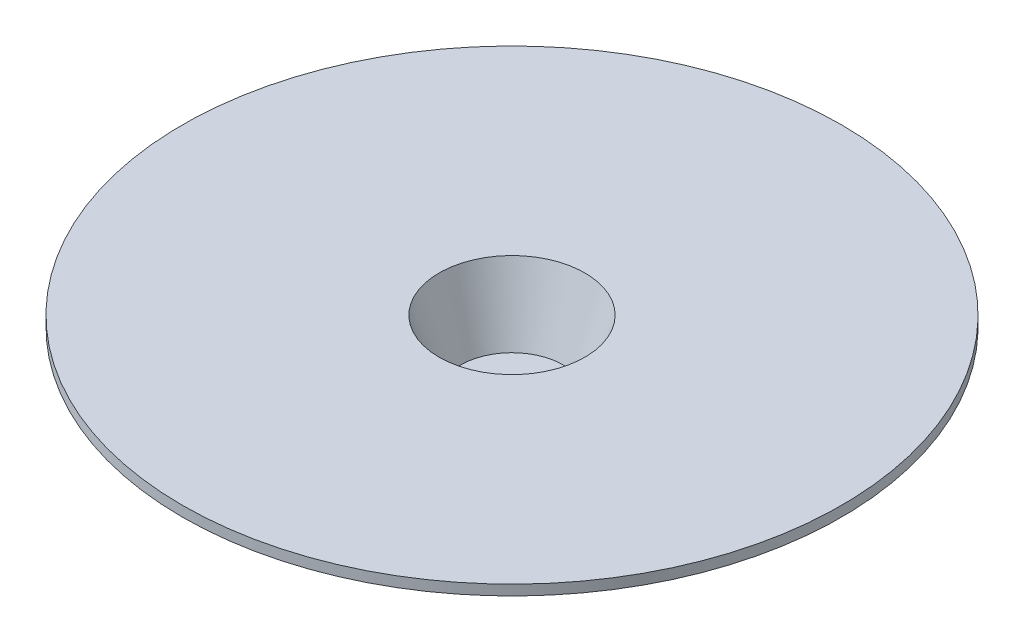
ISO-10303-21;
HEADER;
FILE_DESCRIPTION(('STEP AP214'),'2;1');
FILE_NAME('part.step','',(''),(''),'','','');
FILE_SCHEMA(('AUTOMOTIVE_DESIGN { 1 0 10303 214 1 1 1 1 }'));
ENDSEC;
DATA;
#1=APPLICATION_CONTEXT('core data for automotive mechanical design processes');
#2=APPLICATION_PROTOCOL_DEFINITION('international standard','automotive_design',2000,#1);
#3=PRODUCT_CONTEXT('',#1,'mechanical');
#4=PRODUCT('Part','Part','',(#3));
#5=PRODUCT_RELATED_PRODUCT_CATEGORY('part','',(#4));
#6=PRODUCT_DEFINITION_FORMATION('','',#4);
#7=PRODUCT_DEFINITION_CONTEXT('part definition',#1,'design');
#8=PRODUCT_DEFINITION('design','',#6,#7);
#9=PRODUCT_DEFINITION_SHAPE('','',#8);
#10=(LENGTH_UNIT() NAMED_UNIT(*) SI_UNIT(.MILLI.,.METRE.));
#11=(NAMED_UNIT(*) PLANE_ANGLE_UNIT() SI_UNIT($,.RADIAN.));
#12=(NAMED_UNIT(*) SI_UNIT($,.STERADIAN.) SOLID_ANGLE_UNIT());
#13=UNCERTAINTY_MEASURE_WITH_UNIT(LENGTH_MEASURE(1.E-05),#10,'distance_accuracy_value','');
#14=(GEOMETRIC_REPRESENTATION_CONTEXT(3) GLOBAL_UNCERTAINTY_ASSIGNED_CONTEXT((#13)) GLOBAL_UNIT_ASSIGNED_CONTEXT((#10,
#11,#12)) REPRESENTATION_CONTEXT('',''));
#15=CARTESIAN_POINT('',(0.,0.,0.));
#16=DIRECTION('',(0.,0.,1.));
#17=DIRECTION('',(1.,0.,0.));
#18=AXIS2_PLACEMENT_3D('',#15,#16,#17);
#19=CARTESIAN_POINT('',(0.,-40.25,0.));
#20=DIRECTION('',(0.,-1.,0.));
#21=DIRECTION('',(0.,0.,-1.));
#22=AXIS2_PLACEMENT_3D('',#19,#20,#21);
#23=PLANE('',#22);
#24=CARTESIAN_POINT('',(0.,-40.25,0.));
#25=DIRECTION('',(0.,1.,0.));
#26=DIRECTION('',(0.,0.,1.));
#27=AXIS2_PLACEMENT_3D('',#24,#25,#26);
#28=CIRCLE('',#27,30.);
#29=CARTESIAN_POINT('',(0.,-40.25,30.));
#30=VERTEX_POINT('',#29);
#31=EDGE_CURVE('E10',#30,#30,#28,.T.);
#32=ORIENTED_EDGE('',*,*,#31,.T.);
#33=EDGE_LOOP('',(#32));
#34=FACE_BOUND('',#33,.T.);
#35=ADVANCED_FACE('F41',(#34),#23,.F.);
#36=CARTESIAN_POINT('',(0.,0.,0.));
#37=DIRECTION('',(0.,1.,0.));
#38=DIRECTION('',(0.,0.,1.));
#39=AXIS2_PLACEMENT_3D('',#36,#37,#38);
#40=CONICAL_SURFACE('',#39,42.6498019292145,0.304506404561858);
#41=ORIENTED_EDGE('',*,*,#31,.F.);
#42=EDGE_LOOP('',(#41));
#43=FACE_BOUND('',#42,.T.);
#44=CARTESIAN_POINT('',(0.,0.,0.));
#45=DIRECTION('',(0.,1.,0.));
#46=DIRECTION('',(0.,0.,1.));
#47=AXIS2_PLACEMENT_3D('',#44,#45,#46);
#48=CIRCLE('',#47,42.6498019292145);
#49=CARTESIAN_POINT('',(0.,0.,42.6498019292145));
#50=VERTEX_POINT('',#49);
#51=EDGE_CURVE('E47',#50,#50,#48,.T.);
#52=ORIENTED_EDGE('',*,*,#51,.T.);
#53=EDGE_LOOP('',(#52));
#54=FACE_BOUND('',#53,.T.);
#55=ADVANCED_FACE('F85',(#43,#54),#40,.F.);
#56=CARTESIAN_POINT('',(42.6498019292145,0.,0.));
#57=DIRECTION('',(0.,-1.,0.));
#58=DIRECTION('',(0.,0.,-1.));
#59=AXIS2_PLACEMENT_3D('',#56,#57,#58);
#60=PLANE('',#59);
#61=ORIENTED_EDGE('',*,*,#51,.F.);
#62=EDGE_LOOP('',(#61));
#63=FACE_BOUND('',#62,.T.);
#64=CARTESIAN_POINT('',(0.,0.,0.));
#65=DIRECTION('',(0.,1.,0.));
#66=DIRECTION('',(0.,0.,1.));
#67=AXIS2_PLACEMENT_3D('',#64,#65,#66);
#68=CIRCLE('',#67,192.649801929214);
#69=CARTESIAN_POINT('',(0.,0.,192.649801929214));
#70=VERTEX_POINT('',#69);
#71=EDGE_CURVE('E51',#70,#70,#68,.T.);
#72=ORIENTED_EDGE('',*,*,#71,.T.);
#73=EDGE_LOOP('',(#72));
#74=FACE_BOUND('',#73,.T.);
#75=ADVANCED_FACE('F89',(#63,#74),#60,.F.);
#76=CARTESIAN_POINT('',(0.,-40.25,0.));
#77=DIRECTION('',(0.,1.,0.));
#78=DIRECTION('',(0.,0.,1.));
#79=AXIS2_PLACEMENT_3D('',#76,#77,#78);
#80=CYLINDRICAL_SURFACE('',#79,192.649801929214);
#81=ORIENTED_EDGE('',*,*,#71,.F.);
#82=EDGE_LOOP('',(#81));
#83=FACE_BOUND('',#82,.T.);
#84=CARTESIAN_POINT('',(0.,-6.00000000000001,0.));
#85=DIRECTION('',(0.,1.,0.));
#86=DIRECTION('',(0.,0.,1.));
#87=AXIS2_PLACEMENT_3D('',#84,#85,#86);
#88=CIRCLE('',#87,192.649801929214);
#89=CARTESIAN_POINT('',(0.,-6.00000000000001,192.649801929214));
#90=VERTEX_POINT('',#89);
#91=EDGE_CURVE('E55',#90,#90,#88,.T.);
#92=ORIENTED_EDGE('',*,*,#91,.T.);
#93=EDGE_LOOP('',(#92));
#94=FACE_BOUND('',#93,.T.);
#95=ADVANCED_FACE('F94',(#83,#94),#80,.T.);
#96=CARTESIAN_POINT('',(192.649801929214,-6.00000000000002,0.));
#97=DIRECTION('',(0.,1.,0.));
#98=DIRECTION('',(0.,0.,1.));
#99=AXIS2_PLACEMENT_3D('',#96,#97,#98);
#100=PLANE('',#99);
#101=ORIENTED_EDGE('',*,*,#91,.F.);
#102=EDGE_LOOP('',(#101));
#103=FACE_BOUND('',#102,.T.);
#104=CARTESIAN_POINT('',(0.,-6.00000000000004,0.));
#105=DIRECTION('',(0.,1.,0.));
#106=DIRECTION('',(0.,0.,1.));
#107=AXIS2_PLACEMENT_3D('',#104,#105,#106);
#108=CIRCLE('',#107,46.8968411460303);
#109=CARTESIAN_POINT('',(0.,-6.00000000000004,46.8968411460303));
#110=VERTEX_POINT('',#109);
#111=EDGE_CURVE('E60',#110,#110,#108,.T.);
#112=ORIENTED_EDGE('',*,*,#111,.T.);
#113=EDGE_LOOP('',(#112));
#114=FACE_BOUND('',#113,.T.);
#115=ADVANCED_FACE('F100',(#103,#114),#100,.F.);
#116=CARTESIAN_POINT('',(0.,-40.2971311900001,0.));
#117=DIRECTION('',(0.,1.,0.));
#118=DIRECTION('',(0.,0.,1.));
#119=AXIS2_PLACEMENT_3D('',#116,#117,#118);
#120=CONICAL_SURFACE('',#119,36.1179115486692,0.304506404561857);
#121=ORIENTED_EDGE('',*,*,#111,.F.);
#122=EDGE_LOOP('',(#121));
#123=FACE_BOUND('',#122,.T.);
#124=CARTESIAN_POINT('',(0.,-40.2971311900001,0.));
#125=DIRECTION('',(0.,1.,0.));
#126=DIRECTION('',(0.,0.,1.));
#127=AXIS2_PLACEMENT_3D('',#124,#125,#126);
#128=CIRCLE('',#127,36.1179115486692);
#129=CARTESIAN_POINT('',(0.,-40.2971311900001,36.1179115486692));
#130=VERTEX_POINT('',#129);
#131=EDGE_CURVE('E63',#130,#130,#128,.T.);
#132=ORIENTED_EDGE('',*,*,#131,.T.);
#133=EDGE_LOOP('',(#132));
#134=FACE_BOUND('',#133,.T.);
#135=ADVANCED_FACE('F104',(#123,#134),#120,.T.);
#136=CARTESIAN_POINT('',(36.1179115486692,-40.29713119,0.));
#137=DIRECTION('',(0.,-1.,0.));
#138=DIRECTION('',(0.,0.,-1.));
#139=AXIS2_PLACEMENT_3D('',#136,#137,#138);
#140=PLANE('',#139);
#141=ORIENTED_EDGE('',*,*,#131,.F.);
#142=EDGE_LOOP('',(#141));
#143=FACE_BOUND('',#142,.T.);
#144=CARTESIAN_POINT('',(0.,-40.29713119,0.));
#145=DIRECTION('',(0.,1.,0.));
#146=DIRECTION('',(0.,0.,1.));
#147=AXIS2_PLACEMENT_3D('',#144,#145,#146);
#148=CIRCLE('',#147,55.5);
#149=CARTESIAN_POINT('',(0.,-40.29713119,55.5));
#150=VERTEX_POINT('',#149);
#151=EDGE_CURVE('E66',#150,#150,#148,.T.);
#152=ORIENTED_EDGE('',*,*,#151,.T.);
#153=EDGE_LOOP('',(#152));
#154=FACE_BOUND('',#153,.T.);
#155=ADVANCED_FACE('F81',(#143,#154),#140,.F.);
#156=CARTESIAN_POINT('',(0.,-40.25,0.));
#157=DIRECTION('',(0.,1.,0.));
#158=DIRECTION('',(0.,0.,1.));
#159=AXIS2_PLACEMENT_3D('',#156,#157,#158);
#160=CYLINDRICAL_SURFACE('',#159,55.5);
#161=ORIENTED_EDGE('',*,*,#151,.F.);
#162=EDGE_LOOP('',(#161));
#163=FACE_BOUND('',#162,.T.);
#164=CARTESIAN_POINT('',(0.,-46.25,0.));
#165=DIRECTION('',(0.,1.,0.));
#166=DIRECTION('',(0.,0.,1.));
#167=AXIS2_PLACEMENT_3D('',#164,#165,#166);
#168=CIRCLE('',#167,55.5);
#169=CARTESIAN_POINT('',(0.,-46.25,55.5));
#170=VERTEX_POINT('',#169);
#171=EDGE_CURVE('E69',#170,#170,#168,.T.);
#172=ORIENTED_EDGE('',*,*,#171,.T.);
#173=EDGE_LOOP('',(#172));
#174=FACE_BOUND('',#173,.T.);
#175=ADVANCED_FACE('F73',(#163,#174),#160,.T.);
#176=CARTESIAN_POINT('',(55.5,-46.25,0.));
#177=DIRECTION('',(0.,1.,0.));
#178=DIRECTION('',(0.,0.,1.));
#179=AXIS2_PLACEMENT_3D('',#176,#177,#178);
#180=PLANE('',#179);
#181=ORIENTED_EDGE('',*,*,#171,.F.);
#182=EDGE_LOOP('',(#181));
#183=FACE_BOUND('',#182,.T.);
#184=ADVANCED_FACE('F75',(#183),#180,.F.);
#185=CLOSED_SHELL('',(#35,#55,#75,#95,#115,#135,#155,#175,#184));
#186=MANIFOLD_SOLID_BREP('B2',#185);
#187=ADVANCED_BREP_SHAPE_REPRESENTATION('',(#18,#186),#14);
#188=SHAPE_DEFINITION_REPRESENTATION(#9,#187);
ENDSEC;
END-ISO-10303-21;
